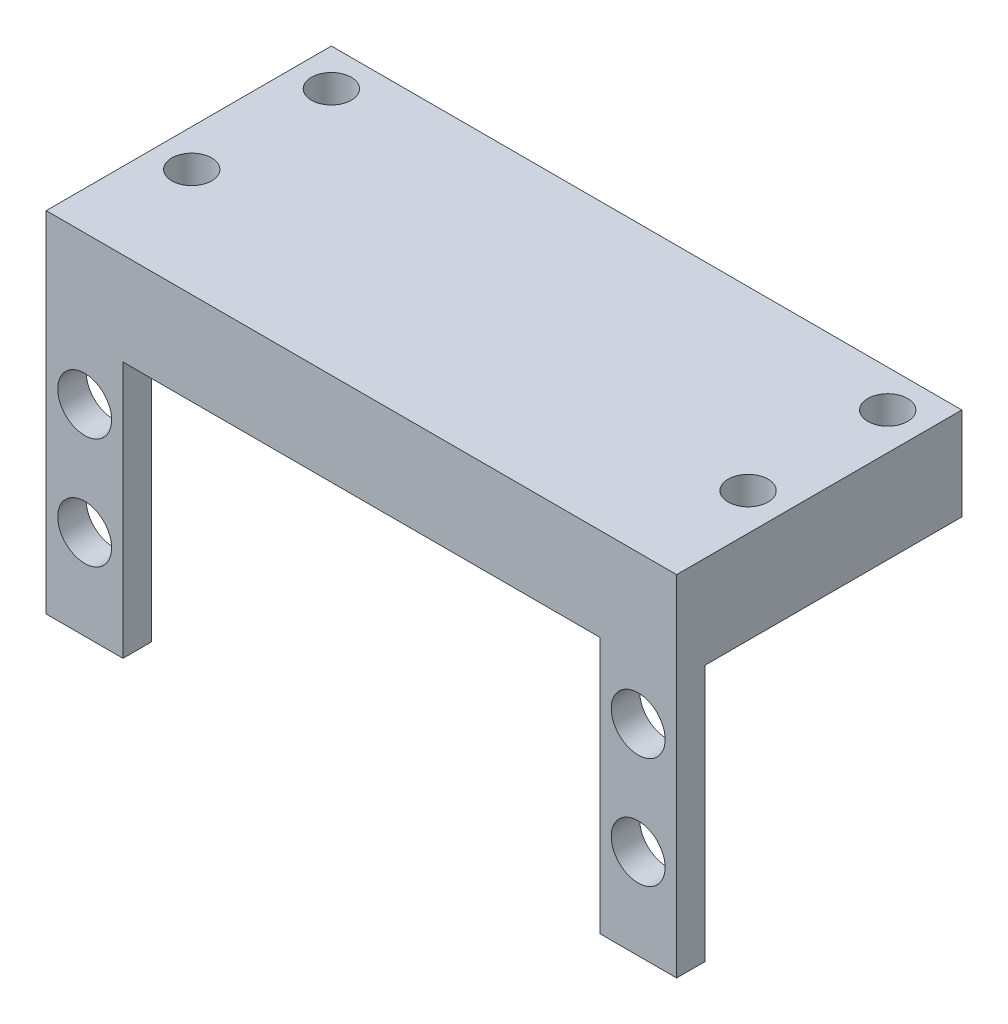
ISO-10303-21;
HEADER;
FILE_DESCRIPTION(('STEP AP214'),'2;1');
FILE_NAME('part.step','',(''),(''),'','','');
FILE_SCHEMA(('AUTOMOTIVE_DESIGN { 1 0 10303 214 1 1 1 1 }'));
ENDSEC;
DATA;
#1=APPLICATION_CONTEXT('core data for automotive mechanical design processes');
#2=APPLICATION_PROTOCOL_DEFINITION('international standard','automotive_design',2000,#1);
#3=PRODUCT_CONTEXT('',#1,'mechanical');
#4=PRODUCT('Part','Part','',(#3));
#5=PRODUCT_RELATED_PRODUCT_CATEGORY('part','',(#4));
#6=PRODUCT_DEFINITION_FORMATION('','',#4);
#7=PRODUCT_DEFINITION_CONTEXT('part definition',#1,'design');
#8=PRODUCT_DEFINITION('design','',#6,#7);
#9=PRODUCT_DEFINITION_SHAPE('','',#8);
#10=(LENGTH_UNIT() NAMED_UNIT(*) SI_UNIT(.MILLI.,.METRE.));
#11=(NAMED_UNIT(*) PLANE_ANGLE_UNIT() SI_UNIT($,.RADIAN.));
#12=(NAMED_UNIT(*) SI_UNIT($,.STERADIAN.) SOLID_ANGLE_UNIT());
#13=UNCERTAINTY_MEASURE_WITH_UNIT(LENGTH_MEASURE(1.E-05),#10,'distance_accuracy_value','');
#14=(GEOMETRIC_REPRESENTATION_CONTEXT(3) GLOBAL_UNCERTAINTY_ASSIGNED_CONTEXT((#13)) GLOBAL_UNIT_ASSIGNED_CONTEXT((#10,
#11,#12)) REPRESENTATION_CONTEXT('',''));
#15=CARTESIAN_POINT('',(0.,0.,0.));
#16=DIRECTION('',(0.,0.,1.));
#17=DIRECTION('',(1.,0.,0.));
#18=AXIS2_PLACEMENT_3D('',#15,#16,#17);
#19=CARTESIAN_POINT('',(0.,-2.54,0.));
#20=DIRECTION('',(0.,0.,1.));
#21=DIRECTION('',(1.,0.,0.));
#22=AXIS2_PLACEMENT_3D('',#19,#20,#21);
#23=PLANE('',#22);
#24=CARTESIAN_POINT('',(3.42499999999999,-17.385,0.));
#25=DIRECTION('',(0.,0.,1.));
#26=DIRECTION('',(1.,0.,0.));
#27=AXIS2_PLACEMENT_3D('',#24,#25,#26);
#28=CIRCLE('',#27,2.400000018);
#29=CARTESIAN_POINT('',(5.825000018,-17.385,0.));
#30=VERTEX_POINT('',#29);
#31=EDGE_CURVE('E183',#30,#30,#28,.T.);
#32=ORIENTED_EDGE('',*,*,#31,.F.);
#33=EDGE_LOOP('',(#32));
#34=FACE_BOUND('',#33,.T.);
#35=CARTESIAN_POINT('',(52.725,-7.51500000000001,0.));
#36=DIRECTION('',(0.,0.,1.));
#37=DIRECTION('',(1.,0.,0.));
#38=AXIS2_PLACEMENT_3D('',#35,#36,#37);
#39=CIRCLE('',#38,2.40000001800001);
#40=CARTESIAN_POINT('',(55.125000018,-7.51500000000001,0.));
#41=VERTEX_POINT('',#40);
#42=EDGE_CURVE('E182',#41,#41,#39,.T.);
#43=ORIENTED_EDGE('',*,*,#42,.F.);
#44=EDGE_LOOP('',(#43));
#45=FACE_BOUND('',#44,.T.);
#46=CARTESIAN_POINT('',(52.725,-17.385,0.));
#47=DIRECTION('',(0.,0.,1.));
#48=DIRECTION('',(1.,0.,0.));
#49=AXIS2_PLACEMENT_3D('',#46,#47,#48);
#50=CIRCLE('',#49,2.40000001800001);
#51=CARTESIAN_POINT('',(55.125000018,-17.385,0.));
#52=VERTEX_POINT('',#51);
#53=EDGE_CURVE('E179',#52,#52,#50,.T.);
#54=ORIENTED_EDGE('',*,*,#53,.F.);
#55=EDGE_LOOP('',(#54));
#56=FACE_BOUND('',#55,.T.);
#57=CARTESIAN_POINT('',(3.42499999999999,-7.51500000000002,0.));
#58=DIRECTION('',(0.,0.,1.));
#59=DIRECTION('',(1.,0.,0.));
#60=AXIS2_PLACEMENT_3D('',#57,#58,#59);
#61=CIRCLE('',#60,2.400000018);
#62=CARTESIAN_POINT('',(5.825000018,-7.51500000000002,0.));
#63=VERTEX_POINT('',#62);
#64=EDGE_CURVE('E186',#63,#63,#61,.T.);
#65=ORIENTED_EDGE('',*,*,#64,.F.);
#66=EDGE_LOOP('',(#65));
#67=FACE_BOUND('',#66,.T.);
#68=DIRECTION('',(1.,0.,0.));
#69=VECTOR('',#68,1.);
#70=CARTESIAN_POINT('',(0.,-2.54,0.));
#71=LINE('',#70,#69);
#72=CARTESIAN_POINT('',(6.841000018,-2.54,0.));
#73=VERTEX_POINT('',#72);
#74=CARTESIAN_POINT('',(49.308999982,-2.54,0.));
#75=VERTEX_POINT('',#74);
#76=EDGE_CURVE('E118',#73,#75,#71,.T.);
#77=ORIENTED_EDGE('',*,*,#76,.T.);
#78=DIRECTION('',(0.,-1.,0.));
#79=VECTOR('',#78,1.);
#80=CARTESIAN_POINT('',(49.308999982,0.,0.));
#81=LINE('',#80,#79);
#82=CARTESIAN_POINT('',(49.308999982,-25.4,0.));
#83=VERTEX_POINT('',#82);
#84=EDGE_CURVE('E127',#75,#83,#81,.T.);
#85=ORIENTED_EDGE('',*,*,#84,.T.);
#86=DIRECTION('',(1.,0.,0.));
#87=VECTOR('',#86,1.);
#88=CARTESIAN_POINT('',(0.,-25.4,0.));
#89=LINE('',#88,#87);
#90=CARTESIAN_POINT('',(56.15,-25.4,0.));
#91=VERTEX_POINT('',#90);
#92=EDGE_CURVE('E204',#83,#91,#89,.T.);
#93=ORIENTED_EDGE('',*,*,#92,.T.);
#94=DIRECTION('',(0.,1.,0.));
#95=VECTOR('',#94,1.);
#96=CARTESIAN_POINT('',(56.15,-2.54,0.));
#97=LINE('',#96,#95);
#98=CARTESIAN_POINT('',(56.15,5.715,0.));
#99=VERTEX_POINT('',#98);
#100=EDGE_CURVE('E223',#91,#99,#97,.T.);
#101=ORIENTED_EDGE('',*,*,#100,.T.);
#102=DIRECTION('',(1.,0.,0.));
#103=VECTOR('',#102,1.);
#104=CARTESIAN_POINT('',(56.15,5.715,0.));
#105=LINE('',#104,#103);
#106=CARTESIAN_POINT('',(0.,5.715,0.));
#107=VERTEX_POINT('',#106);
#108=EDGE_CURVE('E176',#107,#99,#105,.T.);
#109=ORIENTED_EDGE('',*,*,#108,.F.);
#110=DIRECTION('',(0.,1.,0.));
#111=VECTOR('',#110,1.);
#112=CARTESIAN_POINT('',(0.,-2.54,0.));
#113=LINE('',#112,#111);
#114=CARTESIAN_POINT('',(0.,-25.4,0.));
#115=VERTEX_POINT('',#114);
#116=EDGE_CURVE('E218',#115,#107,#113,.T.);
#117=ORIENTED_EDGE('',*,*,#116,.F.);
#118=CARTESIAN_POINT('',(6.841000018,-25.4,0.));
#119=VERTEX_POINT('',#118);
#120=EDGE_CURVE('E195',#115,#119,#89,.T.);
#121=ORIENTED_EDGE('',*,*,#120,.T.);
#122=DIRECTION('',(0.,-1.,0.));
#123=VECTOR('',#122,1.);
#124=CARTESIAN_POINT('',(6.841000018,0.,0.));
#125=LINE('',#124,#123);
#126=EDGE_CURVE('E124',#73,#119,#125,.T.);
#127=ORIENTED_EDGE('',*,*,#126,.F.);
#128=EDGE_LOOP('',(#77,#85,#93,#101,#109,#117,#121,#127));
#129=FACE_BOUND('',#128,.T.);
#130=ADVANCED_FACE('F37',(#34,#45,#56,#67,#129),#23,.T.);
#131=CARTESIAN_POINT('',(0.,-25.4,-2.54));
#132=DIRECTION('',(0.,-1.,0.));
#133=DIRECTION('',(0.,0.,-1.));
#134=AXIS2_PLACEMENT_3D('',#131,#132,#133);
#135=PLANE('',#134);
#136=ORIENTED_EDGE('',*,*,#92,.F.);
#137=DIRECTION('',(0.,0.,1.));
#138=VECTOR('',#137,1.);
#139=CARTESIAN_POINT('',(49.308999982,-25.4,-25.4));
#140=LINE('',#139,#138);
#141=CARTESIAN_POINT('',(49.308999982,-25.4,-2.54));
#142=VERTEX_POINT('',#141);
#143=EDGE_CURVE('E130',#142,#83,#140,.T.);
#144=ORIENTED_EDGE('',*,*,#143,.F.);
#145=DIRECTION('',(1.,0.,0.));
#146=VECTOR('',#145,1.);
#147=CARTESIAN_POINT('',(0.,-25.4,-2.54));
#148=LINE('',#147,#146);
#149=CARTESIAN_POINT('',(56.15,-25.4,-2.54));
#150=VERTEX_POINT('',#149);
#151=EDGE_CURVE('E194',#142,#150,#148,.T.);
#152=ORIENTED_EDGE('',*,*,#151,.T.);
#153=DIRECTION('',(0.,0.,1.));
#154=VECTOR('',#153,1.);
#155=CARTESIAN_POINT('',(56.15,-25.4,-2.54));
#156=LINE('',#155,#154);
#157=EDGE_CURVE('E205',#150,#91,#156,.T.);
#158=ORIENTED_EDGE('',*,*,#157,.T.);
#159=EDGE_LOOP('',(#136,#144,#152,#158));
#160=FACE_BOUND('',#159,.T.);
#161=ADVANCED_FACE('F262',(#160),#135,.T.);
#162=CARTESIAN_POINT('',(0.,0.,-2.54));
#163=DIRECTION('',(0.,0.,1.));
#164=DIRECTION('',(1.,0.,0.));
#165=AXIS2_PLACEMENT_3D('',#162,#163,#164);
#166=PLANE('',#165);
#167=CARTESIAN_POINT('',(52.725,-7.51500000000001,-2.54));
#168=DIRECTION('',(0.,0.,1.));
#169=DIRECTION('',(1.,0.,0.));
#170=AXIS2_PLACEMENT_3D('',#167,#168,#169);
#171=CIRCLE('',#170,2.40000001800001);
#172=CARTESIAN_POINT('',(55.125000018,-7.51500000000001,-2.54));
#173=VERTEX_POINT('',#172);
#174=EDGE_CURVE('E231',#173,#173,#171,.T.);
#175=ORIENTED_EDGE('',*,*,#174,.T.);
#176=EDGE_LOOP('',(#175));
#177=FACE_BOUND('',#176,.T.);
#178=CARTESIAN_POINT('',(52.725,-17.385,-2.54));
#179=DIRECTION('',(0.,0.,1.));
#180=DIRECTION('',(1.,0.,0.));
#181=AXIS2_PLACEMENT_3D('',#178,#179,#180);
#182=CIRCLE('',#181,2.40000001800001);
#183=CARTESIAN_POINT('',(55.125000018,-17.385,-2.54));
#184=VERTEX_POINT('',#183);
#185=EDGE_CURVE('E228',#184,#184,#182,.T.);
#186=ORIENTED_EDGE('',*,*,#185,.T.);
#187=EDGE_LOOP('',(#186));
#188=FACE_BOUND('',#187,.T.);
#189=DIRECTION('',(0.,-1.,0.));
#190=VECTOR('',#189,1.);
#191=CARTESIAN_POINT('',(49.308999982,0.,-2.54));
#192=LINE('',#191,#190);
#193=CARTESIAN_POINT('',(49.308999982,-2.54,-2.54));
#194=VERTEX_POINT('',#193);
#195=EDGE_CURVE('E11',#194,#142,#192,.T.);
#196=ORIENTED_EDGE('',*,*,#195,.F.);
#197=DIRECTION('',(-1.,0.,0.));
#198=VECTOR('',#197,1.);
#199=CARTESIAN_POINT('',(0.,-2.54,-2.54));
#200=LINE('',#199,#198);
#201=CARTESIAN_POINT('',(56.15,-2.54,-2.54));
#202=VERTEX_POINT('',#201);
#203=EDGE_CURVE('E121',#202,#194,#200,.T.);
#204=ORIENTED_EDGE('',*,*,#203,.F.);
#205=DIRECTION('',(0.,1.,0.));
#206=VECTOR('',#205,1.);
#207=CARTESIAN_POINT('',(56.15,0.,-2.54));
#208=LINE('',#207,#206);
#209=EDGE_CURVE('E199',#150,#202,#208,.T.);
#210=ORIENTED_EDGE('',*,*,#209,.F.);
#211=ORIENTED_EDGE('',*,*,#151,.F.);
#212=EDGE_LOOP('',(#196,#204,#210,#211));
#213=FACE_BOUND('',#212,.T.);
#214=ADVANCED_FACE('F265',(#177,#188,#213),#166,.F.);
#215=CARTESIAN_POINT('',(0.,-2.54,0.));
#216=DIRECTION('',(0.,-1.,0.));
#217=DIRECTION('',(0.,0.,-1.));
#218=AXIS2_PLACEMENT_3D('',#215,#216,#217);
#219=PLANE('',#218);
#220=DIRECTION('',(0.,0.,1.));
#221=VECTOR('',#220,1.);
#222=CARTESIAN_POINT('',(0.,-2.54,0.));
#223=LINE('',#222,#221);
#224=CARTESIAN_POINT('',(0.,-2.54,-25.4));
#225=VERTEX_POINT('',#224);
#226=CARTESIAN_POINT('',(0.,-2.54,-2.54));
#227=VERTEX_POINT('',#226);
#228=EDGE_CURVE('E212',#225,#227,#223,.T.);
#229=ORIENTED_EDGE('',*,*,#228,.F.);
#230=DIRECTION('',(-1.,0.,0.));
#231=VECTOR('',#230,1.);
#232=CARTESIAN_POINT('',(0.,-2.54,-25.4));
#233=LINE('',#232,#231);
#234=CARTESIAN_POINT('',(56.15,-2.54,-25.4));
#235=VERTEX_POINT('',#234);
#236=EDGE_CURVE('E60',#235,#225,#233,.T.);
#237=ORIENTED_EDGE('',*,*,#236,.F.);
#238=DIRECTION('',(0.,0.,-1.));
#239=VECTOR('',#238,1.);
#240=CARTESIAN_POINT('',(56.15,-2.54,0.));
#241=LINE('',#240,#239);
#242=EDGE_CURVE('E215',#202,#235,#241,.T.);
#243=ORIENTED_EDGE('',*,*,#242,.F.);
#244=ORIENTED_EDGE('',*,*,#203,.T.);
#245=DIRECTION('',(0.,0.,1.));
#246=VECTOR('',#245,1.);
#247=CARTESIAN_POINT('',(49.308999982,-2.54,-25.4));
#248=LINE('',#247,#246);
#249=EDGE_CURVE('E112',#194,#75,#248,.T.);
#250=ORIENTED_EDGE('',*,*,#249,.T.);
#251=ORIENTED_EDGE('',*,*,#76,.F.);
#252=DIRECTION('',(0.,0.,1.));
#253=VECTOR('',#252,1.);
#254=CARTESIAN_POINT('',(6.841000018,-2.54,-25.4));
#255=LINE('',#254,#253);
#256=CARTESIAN_POINT('',(6.841000018,-2.54,-2.54));
#257=VERTEX_POINT('',#256);
#258=EDGE_CURVE('E52',#257,#73,#255,.T.);
#259=ORIENTED_EDGE('',*,*,#258,.F.);
#260=EDGE_CURVE('E208',#257,#227,#200,.T.);
#261=ORIENTED_EDGE('',*,*,#260,.T.);
#262=EDGE_LOOP('',(#229,#237,#243,#244,#250,#251,#259,#261));
#263=FACE_BOUND('',#262,.T.);
#264=CARTESIAN_POINT('',(3.29800000000001,-2.54,-9.664));
#265=DIRECTION('',(0.,-1.,0.));
#266=DIRECTION('',(0.,0.,-1.));
#267=AXIS2_PLACEMENT_3D('',#264,#265,#266);
#268=CIRCLE('',#267,1.774);
#269=CARTESIAN_POINT('',(3.29800000000001,-2.54,-11.438));
#270=VERTEX_POINT('',#269);
#271=EDGE_CURVE('E154',#270,#270,#268,.F.);
#272=ORIENTED_EDGE('',*,*,#271,.T.);
#273=EDGE_LOOP('',(#272));
#274=FACE_BOUND('',#273,.T.);
#275=CARTESIAN_POINT('',(3.298,-2.54,-22.102));
#276=DIRECTION('',(0.,-1.,0.));
#277=DIRECTION('',(0.,0.,-1.));
#278=AXIS2_PLACEMENT_3D('',#275,#276,#277);
#279=CIRCLE('',#278,1.774);
#280=CARTESIAN_POINT('',(3.298,-2.54,-23.876));
#281=VERTEX_POINT('',#280);
#282=EDGE_CURVE('E139',#281,#281,#279,.F.);
#283=ORIENTED_EDGE('',*,*,#282,.T.);
#284=EDGE_LOOP('',(#283));
#285=FACE_BOUND('',#284,.T.);
#286=CARTESIAN_POINT('',(52.852,-2.54,-22.102));
#287=DIRECTION('',(0.,-1.,0.));
#288=DIRECTION('',(0.,0.,-1.));
#289=AXIS2_PLACEMENT_3D('',#286,#287,#288);
#290=CIRCLE('',#289,1.774);
#291=CARTESIAN_POINT('',(52.852,-2.54,-23.876));
#292=VERTEX_POINT('',#291);
#293=EDGE_CURVE('E147',#292,#292,#290,.T.);
#294=ORIENTED_EDGE('',*,*,#293,.F.);
#295=EDGE_LOOP('',(#294));
#296=FACE_BOUND('',#295,.T.);
#297=CARTESIAN_POINT('',(52.852,-2.54,-9.664));
#298=DIRECTION('',(0.,-1.,0.));
#299=DIRECTION('',(0.,0.,-1.));
#300=AXIS2_PLACEMENT_3D('',#297,#298,#299);
#301=CIRCLE('',#300,1.77400000000001);
#302=CARTESIAN_POINT('',(52.852,-2.54,-11.438));
#303=VERTEX_POINT('',#302);
#304=EDGE_CURVE('E148',#303,#303,#301,.T.);
#305=ORIENTED_EDGE('',*,*,#304,.F.);
#306=EDGE_LOOP('',(#305));
#307=FACE_BOUND('',#306,.T.);
#308=ADVANCED_FACE('F115',(#263,#274,#285,#296,#307),#219,.T.);
#309=CARTESIAN_POINT('',(0.,5.715,0.));
#310=DIRECTION('',(0.,1.,0.));
#311=DIRECTION('',(0.,0.,1.));
#312=AXIS2_PLACEMENT_3D('',#309,#310,#311);
#313=PLANE('',#312);
#314=CARTESIAN_POINT('',(3.29800000000001,5.715,-9.664));
#315=DIRECTION('',(0.,-1.,0.));
#316=DIRECTION('',(0.,0.,-1.));
#317=AXIS2_PLACEMENT_3D('',#314,#315,#316);
#318=CIRCLE('',#317,1.774);
#319=CARTESIAN_POINT('',(3.29800000000001,5.715,-11.438));
#320=VERTEX_POINT('',#319);
#321=EDGE_CURVE('E151',#320,#320,#318,.F.);
#322=ORIENTED_EDGE('',*,*,#321,.F.);
#323=EDGE_LOOP('',(#322));
#324=FACE_BOUND('',#323,.T.);
#325=CARTESIAN_POINT('',(52.852,5.715,-9.664));
#326=DIRECTION('',(0.,-1.,0.));
#327=DIRECTION('',(0.,0.,-1.));
#328=AXIS2_PLACEMENT_3D('',#325,#326,#327);
#329=CIRCLE('',#328,1.77400000000001);
#330=CARTESIAN_POINT('',(52.852,5.715,-11.438));
#331=VERTEX_POINT('',#330);
#332=EDGE_CURVE('E144',#331,#331,#329,.T.);
#333=ORIENTED_EDGE('',*,*,#332,.T.);
#334=EDGE_LOOP('',(#333));
#335=FACE_BOUND('',#334,.T.);
#336=CARTESIAN_POINT('',(52.852,5.715,-22.102));
#337=DIRECTION('',(0.,-1.,0.));
#338=DIRECTION('',(0.,0.,-1.));
#339=AXIS2_PLACEMENT_3D('',#336,#337,#338);
#340=CIRCLE('',#339,1.774);
#341=CARTESIAN_POINT('',(52.852,5.715,-23.876));
#342=VERTEX_POINT('',#341);
#343=EDGE_CURVE('E162',#342,#342,#340,.T.);
#344=ORIENTED_EDGE('',*,*,#343,.T.);
#345=EDGE_LOOP('',(#344));
#346=FACE_BOUND('',#345,.T.);
#347=DIRECTION('',(0.,0.,-1.));
#348=VECTOR('',#347,1.);
#349=CARTESIAN_POINT('',(56.15,5.715,0.));
#350=LINE('',#349,#348);
#351=CARTESIAN_POINT('',(56.15,5.715,-25.4));
#352=VERTEX_POINT('',#351);
#353=EDGE_CURVE('E165',#99,#352,#350,.T.);
#354=ORIENTED_EDGE('',*,*,#353,.T.);
#355=DIRECTION('',(-1.,0.,0.));
#356=VECTOR('',#355,1.);
#357=CARTESIAN_POINT('',(56.15,5.715,-25.4));
#358=LINE('',#357,#356);
#359=CARTESIAN_POINT('',(0.,5.715,-25.4));
#360=VERTEX_POINT('',#359);
#361=EDGE_CURVE('E170',#352,#360,#358,.T.);
#362=ORIENTED_EDGE('',*,*,#361,.T.);
#363=DIRECTION('',(0.,0.,1.));
#364=VECTOR('',#363,1.);
#365=CARTESIAN_POINT('',(0.,5.715,0.));
#366=LINE('',#365,#364);
#367=EDGE_CURVE('E173',#360,#107,#366,.T.);
#368=ORIENTED_EDGE('',*,*,#367,.T.);
#369=ORIENTED_EDGE('',*,*,#108,.T.);
#370=EDGE_LOOP('',(#354,#362,#368,#369));
#371=FACE_BOUND('',#370,.T.);
#372=CARTESIAN_POINT('',(3.298,5.715,-22.102));
#373=DIRECTION('',(0.,-1.,0.));
#374=DIRECTION('',(0.,0.,-1.));
#375=AXIS2_PLACEMENT_3D('',#372,#373,#374);
#376=CIRCLE('',#375,1.774);
#377=CARTESIAN_POINT('',(3.298,5.715,-23.876));
#378=VERTEX_POINT('',#377);
#379=EDGE_CURVE('E157',#378,#378,#376,.F.);
#380=ORIENTED_EDGE('',*,*,#379,.F.);
#381=EDGE_LOOP('',(#380));
#382=FACE_BOUND('',#381,.T.);
#383=ADVANCED_FACE('F257',(#324,#335,#346,#371,#382),#313,.T.);
#384=CARTESIAN_POINT('',(0.,-2.54,0.));
#385=DIRECTION('',(-1.,0.,0.));
#386=DIRECTION('',(0.,0.,1.));
#387=AXIS2_PLACEMENT_3D('',#384,#385,#386);
#388=PLANE('',#387);
#389=ORIENTED_EDGE('',*,*,#116,.T.);
#390=ORIENTED_EDGE('',*,*,#367,.F.);
#391=DIRECTION('',(0.,1.,0.));
#392=VECTOR('',#391,1.);
#393=CARTESIAN_POINT('',(0.,-2.54,-25.4));
#394=LINE('',#393,#392);
#395=EDGE_CURVE('E219',#225,#360,#394,.T.);
#396=ORIENTED_EDGE('',*,*,#395,.F.);
#397=ORIENTED_EDGE('',*,*,#228,.T.);
#398=DIRECTION('',(0.,-1.,0.));
#399=VECTOR('',#398,1.);
#400=CARTESIAN_POINT('',(0.,0.,-2.54));
#401=LINE('',#400,#399);
#402=CARTESIAN_POINT('',(0.,-25.4,-2.54));
#403=VERTEX_POINT('',#402);
#404=EDGE_CURVE('E192',#227,#403,#401,.T.);
#405=ORIENTED_EDGE('',*,*,#404,.T.);
#406=DIRECTION('',(0.,0.,1.));
#407=VECTOR('',#406,1.);
#408=CARTESIAN_POINT('',(0.,-25.4,-2.54));
#409=LINE('',#408,#407);
#410=EDGE_CURVE('E202',#403,#115,#409,.T.);
#411=ORIENTED_EDGE('',*,*,#410,.T.);
#412=EDGE_LOOP('',(#389,#390,#396,#397,#405,#411));
#413=FACE_BOUND('',#412,.T.);
#414=ADVANCED_FACE('F39',(#413),#388,.T.);
#415=CARTESIAN_POINT('',(0.,-2.54,-25.4));
#416=DIRECTION('',(0.,0.,-1.));
#417=DIRECTION('',(-1.,0.,0.));
#418=AXIS2_PLACEMENT_3D('',#415,#416,#417);
#419=PLANE('',#418);
#420=ORIENTED_EDGE('',*,*,#395,.T.);
#421=ORIENTED_EDGE('',*,*,#361,.F.);
#422=DIRECTION('',(0.,1.,0.));
#423=VECTOR('',#422,1.);
#424=CARTESIAN_POINT('',(56.15,-2.54,-25.4));
#425=LINE('',#424,#423);
#426=EDGE_CURVE('E221',#235,#352,#425,.T.);
#427=ORIENTED_EDGE('',*,*,#426,.F.);
#428=ORIENTED_EDGE('',*,*,#236,.T.);
#429=EDGE_LOOP('',(#420,#421,#427,#428));
#430=FACE_BOUND('',#429,.T.);
#431=ADVANCED_FACE('F255',(#430),#419,.T.);
#432=CARTESIAN_POINT('',(56.15,-2.54,0.));
#433=DIRECTION('',(1.,0.,0.));
#434=DIRECTION('',(0.,0.,-1.));
#435=AXIS2_PLACEMENT_3D('',#432,#433,#434);
#436=PLANE('',#435);
#437=ORIENTED_EDGE('',*,*,#209,.T.);
#438=ORIENTED_EDGE('',*,*,#242,.T.);
#439=ORIENTED_EDGE('',*,*,#426,.T.);
#440=ORIENTED_EDGE('',*,*,#353,.F.);
#441=ORIENTED_EDGE('',*,*,#100,.F.);
#442=ORIENTED_EDGE('',*,*,#157,.F.);
#443=EDGE_LOOP('',(#437,#438,#439,#440,#441,#442));
#444=FACE_BOUND('',#443,.T.);
#445=ADVANCED_FACE('F250',(#444),#436,.T.);
#446=DIRECTION('',(0.,0.,1.));
#447=VECTOR('',#446,1.);
#448=CARTESIAN_POINT('',(6.841000018,-25.4,-25.4));
#449=LINE('',#448,#447);
#450=CARTESIAN_POINT('',(6.841000018,-25.4,-2.54));
#451=VERTEX_POINT('',#450);
#452=EDGE_CURVE('E140',#451,#119,#449,.T.);
#453=ORIENTED_EDGE('',*,*,#452,.T.);
#454=ORIENTED_EDGE('',*,*,#120,.F.);
#455=ORIENTED_EDGE('',*,*,#410,.F.);
#456=EDGE_CURVE('E196',#403,#451,#148,.T.);
#457=ORIENTED_EDGE('',*,*,#456,.T.);
#458=EDGE_LOOP('',(#453,#454,#455,#457));
#459=FACE_BOUND('',#458,.T.);
#460=ADVANCED_FACE('F245',(#459),#135,.T.);
#461=CARTESIAN_POINT('',(3.42499999999999,-17.385,-2.54));
#462=DIRECTION('',(0.,0.,1.));
#463=DIRECTION('',(1.,0.,0.));
#464=AXIS2_PLACEMENT_3D('',#461,#462,#463);
#465=CIRCLE('',#464,2.400000018);
#466=CARTESIAN_POINT('',(5.825000018,-17.385,-2.54));
#467=VERTEX_POINT('',#466);
#468=EDGE_CURVE('E234',#467,#467,#465,.T.);
#469=ORIENTED_EDGE('',*,*,#468,.T.);
#470=EDGE_LOOP('',(#469));
#471=FACE_BOUND('',#470,.T.);
#472=CARTESIAN_POINT('',(3.42499999999999,-7.51500000000002,-2.54));
#473=DIRECTION('',(0.,0.,1.));
#474=DIRECTION('',(1.,0.,0.));
#475=AXIS2_PLACEMENT_3D('',#472,#473,#474);
#476=CIRCLE('',#475,2.400000018);
#477=CARTESIAN_POINT('',(5.825000018,-7.51500000000002,-2.54));
#478=VERTEX_POINT('',#477);
#479=EDGE_CURVE('E191',#478,#478,#476,.T.);
#480=ORIENTED_EDGE('',*,*,#479,.T.);
#481=EDGE_LOOP('',(#480));
#482=FACE_BOUND('',#481,.T.);
#483=ORIENTED_EDGE('',*,*,#260,.F.);
#484=DIRECTION('',(0.,-1.,0.));
#485=VECTOR('',#484,1.);
#486=CARTESIAN_POINT('',(6.841000018,0.,-2.54));
#487=LINE('',#486,#485);
#488=EDGE_CURVE('E45',#257,#451,#487,.T.);
#489=ORIENTED_EDGE('',*,*,#488,.T.);
#490=ORIENTED_EDGE('',*,*,#456,.F.);
#491=ORIENTED_EDGE('',*,*,#404,.F.);
#492=EDGE_LOOP('',(#483,#489,#490,#491));
#493=FACE_BOUND('',#492,.T.);
#494=ADVANCED_FACE('F240',(#471,#482,#493),#166,.F.);
#495=CARTESIAN_POINT('',(3.42499999999999,-7.51500000000002,-25.4));
#496=DIRECTION('',(0.,0.,1.));
#497=DIRECTION('',(1.,0.,0.));
#498=AXIS2_PLACEMENT_3D('',#495,#496,#497);
#499=CYLINDRICAL_SURFACE('',#498,2.400000018);
#500=ORIENTED_EDGE('',*,*,#64,.T.);
#501=EDGE_LOOP('',(#500));
#502=FACE_BOUND('',#501,.T.);
#503=ORIENTED_EDGE('',*,*,#479,.F.);
#504=EDGE_LOOP('',(#503));
#505=FACE_BOUND('',#504,.T.);
#506=ADVANCED_FACE('F278',(#502,#505),#499,.F.);
#507=CARTESIAN_POINT('',(52.725,-17.385,-25.4));
#508=DIRECTION('',(0.,0.,1.));
#509=DIRECTION('',(1.,0.,0.));
#510=AXIS2_PLACEMENT_3D('',#507,#508,#509);
#511=CYLINDRICAL_SURFACE('',#510,2.40000001800001);
#512=ORIENTED_EDGE('',*,*,#53,.T.);
#513=EDGE_LOOP('',(#512));
#514=FACE_BOUND('',#513,.T.);
#515=ORIENTED_EDGE('',*,*,#185,.F.);
#516=EDGE_LOOP('',(#515));
#517=FACE_BOUND('',#516,.T.);
#518=ADVANCED_FACE('F307',(#514,#517),#511,.F.);
#519=CARTESIAN_POINT('',(52.725,-7.51500000000001,-25.4));
#520=DIRECTION('',(0.,0.,1.));
#521=DIRECTION('',(1.,0.,0.));
#522=AXIS2_PLACEMENT_3D('',#519,#520,#521);
#523=CYLINDRICAL_SURFACE('',#522,2.40000001800001);
#524=ORIENTED_EDGE('',*,*,#42,.T.);
#525=EDGE_LOOP('',(#524));
#526=FACE_BOUND('',#525,.T.);
#527=ORIENTED_EDGE('',*,*,#174,.F.);
#528=EDGE_LOOP('',(#527));
#529=FACE_BOUND('',#528,.T.);
#530=ADVANCED_FACE('F314',(#526,#529),#523,.F.);
#531=CARTESIAN_POINT('',(3.42499999999999,-17.385,-25.4));
#532=DIRECTION('',(0.,0.,1.));
#533=DIRECTION('',(1.,0.,0.));
#534=AXIS2_PLACEMENT_3D('',#531,#532,#533);
#535=CYLINDRICAL_SURFACE('',#534,2.400000018);
#536=ORIENTED_EDGE('',*,*,#31,.T.);
#537=EDGE_LOOP('',(#536));
#538=FACE_BOUND('',#537,.T.);
#539=ORIENTED_EDGE('',*,*,#468,.F.);
#540=EDGE_LOOP('',(#539));
#541=FACE_BOUND('',#540,.T.);
#542=ADVANCED_FACE('F322',(#538,#541),#535,.F.);
#543=CARTESIAN_POINT('',(52.852,5.715,-22.102));
#544=DIRECTION('',(0.,-1.,0.));
#545=DIRECTION('',(0.,0.,-1.));
#546=AXIS2_PLACEMENT_3D('',#543,#544,#545);
#547=CYLINDRICAL_SURFACE('',#546,1.774);
#548=ORIENTED_EDGE('',*,*,#343,.F.);
#549=EDGE_LOOP('',(#548));
#550=FACE_BOUND('',#549,.T.);
#551=ORIENTED_EDGE('',*,*,#293,.T.);
#552=EDGE_LOOP('',(#551));
#553=FACE_BOUND('',#552,.T.);
#554=ADVANCED_FACE('F330',(#550,#553),#547,.F.);
#555=CARTESIAN_POINT('',(52.852,5.715,-9.664));
#556=DIRECTION('',(0.,-1.,0.));
#557=DIRECTION('',(0.,0.,-1.));
#558=AXIS2_PLACEMENT_3D('',#555,#556,#557);
#559=CYLINDRICAL_SURFACE('',#558,1.77400000000001);
#560=ORIENTED_EDGE('',*,*,#332,.F.);
#561=EDGE_LOOP('',(#560));
#562=FACE_BOUND('',#561,.T.);
#563=ORIENTED_EDGE('',*,*,#304,.T.);
#564=EDGE_LOOP('',(#563));
#565=FACE_BOUND('',#564,.T.);
#566=ADVANCED_FACE('F339',(#562,#565),#559,.F.);
#567=CARTESIAN_POINT('',(3.29800000000001,5.715,-9.664));
#568=DIRECTION('',(0.,-1.,0.));
#569=DIRECTION('',(0.,0.,-1.));
#570=AXIS2_PLACEMENT_3D('',#567,#568,#569);
#571=CYLINDRICAL_SURFACE('',#570,1.774);
#572=ORIENTED_EDGE('',*,*,#321,.T.);
#573=EDGE_LOOP('',(#572));
#574=FACE_BOUND('',#573,.T.);
#575=ORIENTED_EDGE('',*,*,#271,.F.);
#576=EDGE_LOOP('',(#575));
#577=FACE_BOUND('',#576,.T.);
#578=ADVANCED_FACE('F348',(#574,#577),#571,.F.);
#579=CARTESIAN_POINT('',(3.298,5.715,-22.102));
#580=DIRECTION('',(0.,-1.,0.));
#581=DIRECTION('',(0.,0.,-1.));
#582=AXIS2_PLACEMENT_3D('',#579,#580,#581);
#583=CYLINDRICAL_SURFACE('',#582,1.774);
#584=ORIENTED_EDGE('',*,*,#379,.T.);
#585=EDGE_LOOP('',(#584));
#586=FACE_BOUND('',#585,.T.);
#587=ORIENTED_EDGE('',*,*,#282,.F.);
#588=EDGE_LOOP('',(#587));
#589=FACE_BOUND('',#588,.T.);
#590=ADVANCED_FACE('F356',(#586,#589),#583,.F.);
#591=CARTESIAN_POINT('',(49.308999982,0.,-25.4));
#592=DIRECTION('',(-1.,0.,0.));
#593=DIRECTION('',(0.,0.,1.));
#594=AXIS2_PLACEMENT_3D('',#591,#592,#593);
#595=PLANE('',#594);
#596=ORIENTED_EDGE('',*,*,#195,.T.);
#597=ORIENTED_EDGE('',*,*,#143,.T.);
#598=ORIENTED_EDGE('',*,*,#84,.F.);
#599=ORIENTED_EDGE('',*,*,#249,.F.);
#600=EDGE_LOOP('',(#596,#597,#598,#599));
#601=FACE_BOUND('',#600,.T.);
#602=ADVANCED_FACE('F128',(#601),#595,.T.);
#603=CARTESIAN_POINT('',(6.841000018,0.,-25.4));
#604=DIRECTION('',(-1.,0.,0.));
#605=DIRECTION('',(0.,-1.,0.));
#606=AXIS2_PLACEMENT_3D('',#603,#604,#605);
#607=PLANE('',#606);
#608=ORIENTED_EDGE('',*,*,#258,.T.);
#609=ORIENTED_EDGE('',*,*,#126,.T.);
#610=ORIENTED_EDGE('',*,*,#452,.F.);
#611=ORIENTED_EDGE('',*,*,#488,.F.);
#612=EDGE_LOOP('',(#608,#609,#610,#611));
#613=FACE_BOUND('',#612,.T.);
#614=ADVANCED_FACE('F370',(#613),#607,.F.);
#615=CLOSED_SHELL('',(#130,#161,#214,#308,#383,#414,#431,#445,#460,#494,#506,#518,#530,#542,
#554,#566,#578,#590,#602,#614));
#616=MANIFOLD_SOLID_BREP('B2',#615);
#617=ADVANCED_BREP_SHAPE_REPRESENTATION('',(#18,#616),#14);
#618=SHAPE_DEFINITION_REPRESENTATION(#9,#617);
ENDSEC;
END-ISO-10303-21;
